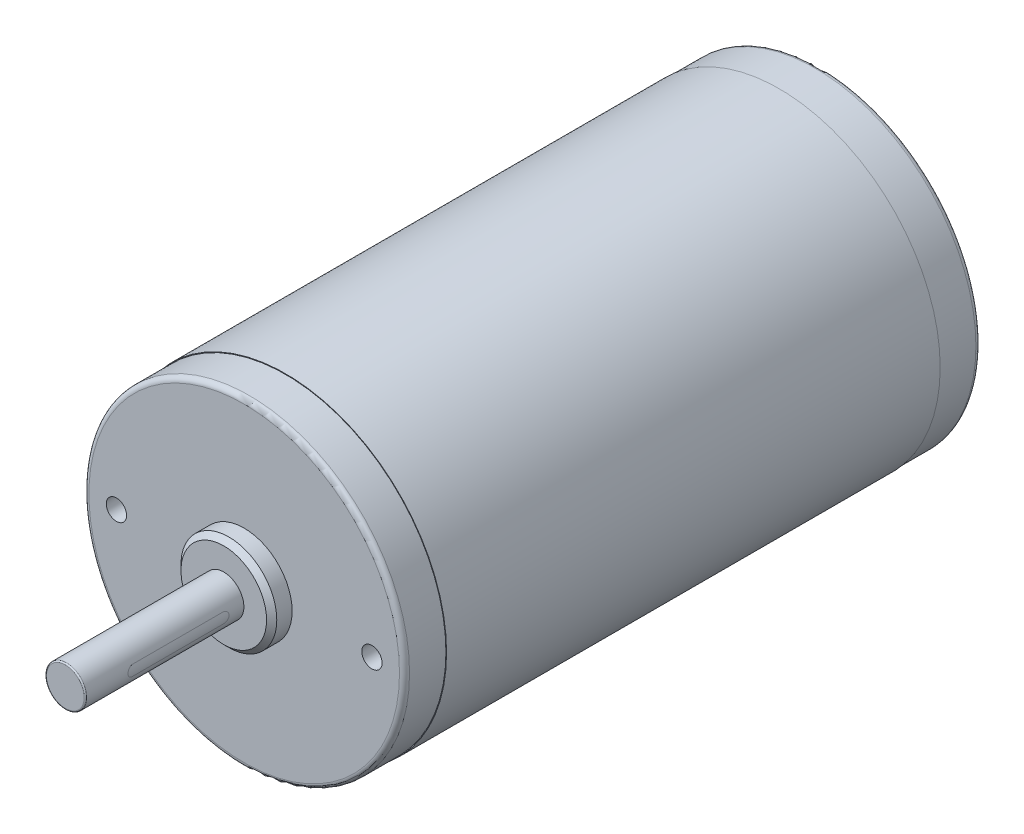
ISO-10303-21;
HEADER;
FILE_DESCRIPTION(('STEP AP214'),'2;1');
FILE_NAME('part.step','',(''),(''),'','','');
FILE_SCHEMA(('AUTOMOTIVE_DESIGN { 1 0 10303 214 1 1 1 1 }'));
ENDSEC;
DATA;
#1=APPLICATION_CONTEXT('core data for automotive mechanical design processes');
#2=APPLICATION_PROTOCOL_DEFINITION('international standard','automotive_design',2000,#1);
#3=PRODUCT_CONTEXT('',#1,'mechanical');
#4=PRODUCT('Part','Part','',(#3));
#5=PRODUCT_RELATED_PRODUCT_CATEGORY('part','',(#4));
#6=PRODUCT_DEFINITION_FORMATION('','',#4);
#7=PRODUCT_DEFINITION_CONTEXT('part definition',#1,'design');
#8=PRODUCT_DEFINITION('design','',#6,#7);
#9=PRODUCT_DEFINITION_SHAPE('','',#8);
#10=(LENGTH_UNIT() NAMED_UNIT(*) SI_UNIT(.MILLI.,.METRE.));
#11=(NAMED_UNIT(*) PLANE_ANGLE_UNIT() SI_UNIT($,.RADIAN.));
#12=(NAMED_UNIT(*) SI_UNIT($,.STERADIAN.) SOLID_ANGLE_UNIT());
#13=UNCERTAINTY_MEASURE_WITH_UNIT(LENGTH_MEASURE(1.E-05),#10,'distance_accuracy_value','');
#14=(GEOMETRIC_REPRESENTATION_CONTEXT(3) GLOBAL_UNCERTAINTY_ASSIGNED_CONTEXT((#13)) GLOBAL_UNIT_ASSIGNED_CONTEXT((#10,
#11,#12)) REPRESENTATION_CONTEXT('',''));
#15=CARTESIAN_POINT('',(0.,0.,0.));
#16=DIRECTION('',(0.,0.,1.));
#17=DIRECTION('',(1.,0.,0.));
#18=AXIS2_PLACEMENT_3D('',#15,#16,#17);
#19=CARTESIAN_POINT('',(35.56,109.2962,10.8204000000007));
#20=DIRECTION('',(0.,0.,-1.));
#21=DIRECTION('',(-1.,0.,0.));
#22=AXIS2_PLACEMENT_3D('',#19,#20,#21);
#23=CYLINDRICAL_SURFACE('',#22,32.0040000000005);
#24=CARTESIAN_POINT('',(35.56,109.2962,10.8204000000007));
#25=DIRECTION('',(0.,0.,-1.));
#26=DIRECTION('',(-1.,0.,0.));
#27=AXIS2_PLACEMENT_3D('',#24,#25,#26);
#28=CIRCLE('',#27,32.0040000000005);
#29=CARTESIAN_POINT('',(3.5559999999995,109.2962,10.8204000000007));
#30=VERTEX_POINT('',#29);
#31=EDGE_CURVE('P0_E181',#30,#30,#28,.T.);
#32=ORIENTED_EDGE('',*,*,#31,.T.);
#33=EDGE_LOOP('',(#32));
#34=FACE_BOUND('',#33,.T.);
#35=CARTESIAN_POINT('',(35.56,109.2962,-87.325199999998));
#36=DIRECTION('',(0.,0.,-1.));
#37=DIRECTION('',(-1.,0.,0.));
#38=AXIS2_PLACEMENT_3D('',#35,#36,#37);
#39=CIRCLE('',#38,32.0040000000005);
#40=CARTESIAN_POINT('',(3.5559999999995,109.2962,-87.325199999998));
#41=VERTEX_POINT('',#40);
#42=EDGE_CURVE('P0_E178',#41,#41,#39,.T.);
#43=ORIENTED_EDGE('',*,*,#42,.F.);
#44=EDGE_LOOP('',(#43));
#45=FACE_BOUND('',#44,.T.);
#46=ADVANCED_FACE('P0_F39',(#34,#45),#23,.T.);
#47=CARTESIAN_POINT('',(67.5640000000005,109.2962,10.8204000000007));
#48=DIRECTION('',(0.,0.,1.));
#49=DIRECTION('',(1.,0.,0.));
#50=AXIS2_PLACEMENT_3D('',#47,#48,#49);
#51=PLANE('',#50);
#52=CARTESIAN_POINT('',(35.56,109.2962,10.8204000000007));
#53=DIRECTION('',(0.,0.,1.));
#54=DIRECTION('',(1.,0.,0.));
#55=AXIS2_PLACEMENT_3D('',#52,#53,#54);
#56=CIRCLE('',#55,31.8770000000005);
#57=CARTESIAN_POINT('',(67.4370000000005,109.2962,10.8204000000007));
#58=VERTEX_POINT('',#57);
#59=EDGE_CURVE('P0_E169',#58,#58,#56,.T.);
#60=ORIENTED_EDGE('',*,*,#59,.F.);
#61=EDGE_LOOP('',(#60));
#62=FACE_BOUND('',#61,.T.);
#63=ORIENTED_EDGE('',*,*,#31,.F.);
#64=EDGE_LOOP('',(#63));
#65=FACE_BOUND('',#64,.T.);
#66=ADVANCED_FACE('P0_F228',(#62,#65),#51,.T.);
#67=CARTESIAN_POINT('',(35.56,109.2962,-87.325199999998));
#68=DIRECTION('',(0.,0.,-1.));
#69=DIRECTION('',(-1.,0.,0.));
#70=AXIS2_PLACEMENT_3D('',#67,#68,#69);
#71=PLANE('',#70);
#72=CARTESIAN_POINT('',(35.56,109.2962,-87.325199999998));
#73=DIRECTION('',(0.,0.,-1.));
#74=DIRECTION('',(-1.,0.,0.));
#75=AXIS2_PLACEMENT_3D('',#72,#73,#74);
#76=CIRCLE('',#75,31.8770000000005);
#77=CARTESIAN_POINT('',(3.68299999999951,109.2962,-87.325199999998));
#78=VERTEX_POINT('',#77);
#79=EDGE_CURVE('P0_E175',#78,#78,#76,.T.);
#80=ORIENTED_EDGE('',*,*,#79,.F.);
#81=EDGE_LOOP('',(#80));
#82=FACE_BOUND('',#81,.T.);
#83=ORIENTED_EDGE('',*,*,#42,.T.);
#84=EDGE_LOOP('',(#83));
#85=FACE_BOUND('',#84,.T.);
#86=ADVANCED_FACE('P0_F234',(#82,#85),#71,.T.);
#87=CARTESIAN_POINT('',(35.56,109.2962,-95.554799999998));
#88=DIRECTION('',(0.,0.,1.));
#89=DIRECTION('',(1.,0.,0.));
#90=AXIS2_PLACEMENT_3D('',#87,#88,#89);
#91=CYLINDRICAL_SURFACE('',#90,31.8770000000005);
#92=CARTESIAN_POINT('',(35.56,109.2962,-94.554799999998));
#93=DIRECTION('',(0.,0.,-1.));
#94=DIRECTION('',(-1.,0.,0.));
#95=AXIS2_PLACEMENT_3D('',#92,#93,#94);
#96=CIRCLE('',#95,31.8770000000005);
#97=CARTESIAN_POINT('',(3.68299999999951,109.2962,-94.554799999998));
#98=VERTEX_POINT('',#97);
#99=EDGE_CURVE('P0_E211',#98,#98,#96,.F.);
#100=ORIENTED_EDGE('',*,*,#99,.T.);
#101=EDGE_LOOP('',(#100));
#102=FACE_BOUND('',#101,.T.);
#103=ORIENTED_EDGE('',*,*,#79,.T.);
#104=EDGE_LOOP('',(#103));
#105=FACE_BOUND('',#104,.T.);
#106=ADVANCED_FACE('P0_F292',(#102,#105),#91,.T.);
#107=CARTESIAN_POINT('',(35.56,109.2962,-95.554799999998));
#108=DIRECTION('',(0.,0.,-1.));
#109=DIRECTION('',(-1.,0.,0.));
#110=AXIS2_PLACEMENT_3D('',#107,#108,#109);
#111=PLANE('',#110);
#112=CARTESIAN_POINT('',(35.56,109.2962,-95.554799999998));
#113=DIRECTION('',(0.,0.,-1.));
#114=DIRECTION('',(-1.,0.,0.));
#115=AXIS2_PLACEMENT_3D('',#112,#113,#114);
#116=CIRCLE('',#115,30.8770000000005);
#117=CARTESIAN_POINT('',(4.6829999999995,109.2962,-95.554799999998));
#118=VERTEX_POINT('',#117);
#119=EDGE_CURVE('P0_E208',#118,#118,#116,.T.);
#120=ORIENTED_EDGE('',*,*,#119,.T.);
#121=EDGE_LOOP('',(#120));
#122=FACE_BOUND('',#121,.T.);
#123=CARTESIAN_POINT('',(46.76735963712,127.903290682857,-95.554799999998));
#124=DIRECTION('',(0.,0.,-1.));
#125=DIRECTION('',(-1.,0.,0.));
#126=AXIS2_PLACEMENT_3D('',#123,#124,#125);
#127=CIRCLE('',#126,4.31800000197918);
#128=CARTESIAN_POINT('',(42.4493596351408,127.903290682857,-95.554799999998));
#129=VERTEX_POINT('',#128);
#130=EDGE_CURVE('P0_E187',#129,#129,#127,.T.);
#131=ORIENTED_EDGE('',*,*,#130,.F.);
#132=EDGE_LOOP('',(#131));
#133=FACE_BOUND('',#132,.T.);
#134=CARTESIAN_POINT('',(54.1670906808811,120.503559639095,-95.554799999998));
#135=DIRECTION('',(0.,0.,-1.));
#136=DIRECTION('',(-1.,0.,0.));
#137=AXIS2_PLACEMENT_3D('',#134,#135,#136);
#138=CIRCLE('',#137,4.3180000019652);
#139=CARTESIAN_POINT('',(49.8490906789159,120.503559639095,-95.554799999998));
#140=VERTEX_POINT('',#139);
#141=EDGE_CURVE('P0_E184',#140,#140,#138,.T.);
#142=ORIENTED_EDGE('',*,*,#141,.F.);
#143=EDGE_LOOP('',(#142));
#144=FACE_BOUND('',#143,.T.);
#145=CARTESIAN_POINT('',(35.56,109.2962,-95.554799999998));
#146=DIRECTION('',(0.,0.,-1.));
#147=DIRECTION('',(-1.,0.,0.));
#148=AXIS2_PLACEMENT_3D('',#145,#146,#147);
#149=CIRCLE('',#148,15.0368000000003);
#150=CARTESIAN_POINT('',(20.5231999999997,109.2962,-95.554799999998));
#151=VERTEX_POINT('',#150);
#152=EDGE_CURVE('P0_E172',#151,#151,#149,.T.);
#153=ORIENTED_EDGE('',*,*,#152,.F.);
#154=EDGE_LOOP('',(#153));
#155=FACE_BOUND('',#154,.T.);
#156=ADVANCED_FACE('P0_F288',(#122,#133,#144,#155),#111,.T.);
#157=CARTESIAN_POINT('',(35.56,109.2962,-100.317299999998));
#158=DIRECTION('',(0.,0.,1.));
#159=DIRECTION('',(1.,0.,0.));
#160=AXIS2_PLACEMENT_3D('',#157,#158,#159);
#161=CYLINDRICAL_SURFACE('',#160,15.0368000000003);
#162=CARTESIAN_POINT('',(35.56,109.2962,-99.317299999998));
#163=DIRECTION('',(0.,0.,-1.));
#164=DIRECTION('',(-1.,0.,0.));
#165=AXIS2_PLACEMENT_3D('',#162,#163,#164);
#166=CIRCLE('',#165,15.0368000000003);
#167=CARTESIAN_POINT('',(20.5231999999997,109.2962,-99.317299999998));
#168=VERTEX_POINT('',#167);
#169=EDGE_CURVE('P0_E11',#168,#168,#166,.F.);
#170=ORIENTED_EDGE('',*,*,#169,.T.);
#171=EDGE_LOOP('',(#170));
#172=FACE_BOUND('',#171,.T.);
#173=ORIENTED_EDGE('',*,*,#152,.T.);
#174=EDGE_LOOP('',(#173));
#175=FACE_BOUND('',#174,.T.);
#176=ADVANCED_FACE('P0_F285',(#172,#175),#161,.T.);
#177=CARTESIAN_POINT('',(35.56,109.2962,-100.317299999998));
#178=DIRECTION('',(0.,0.,-1.));
#179=DIRECTION('',(-1.,0.,0.));
#180=AXIS2_PLACEMENT_3D('',#177,#178,#179);
#181=PLANE('',#180);
#182=CARTESIAN_POINT('',(35.56,109.2962,-100.317299999998));
#183=DIRECTION('',(0.,0.,-1.));
#184=DIRECTION('',(-1.,0.,0.));
#185=AXIS2_PLACEMENT_3D('',#182,#183,#184);
#186=CIRCLE('',#185,14.0368000000003);
#187=CARTESIAN_POINT('',(21.5231999999997,109.2962,-100.317299999998));
#188=VERTEX_POINT('',#187);
#189=EDGE_CURVE('P0_E47',#188,#188,#186,.T.);
#190=ORIENTED_EDGE('',*,*,#189,.T.);
#191=EDGE_LOOP('',(#190));
#192=FACE_BOUND('',#191,.T.);
#193=ADVANCED_FACE('P0_F216',(#192),#181,.T.);
#194=CARTESIAN_POINT('',(35.56,109.2962,19.05));
#195=DIRECTION('',(0.,0.,-1.));
#196=DIRECTION('',(-1.,0.,0.));
#197=AXIS2_PLACEMENT_3D('',#194,#195,#196);
#198=CYLINDRICAL_SURFACE('',#197,31.8770000000005);
#199=CARTESIAN_POINT('',(35.56,109.2962,18.05));
#200=DIRECTION('',(0.,0.,1.));
#201=DIRECTION('',(1.,0.,0.));
#202=AXIS2_PLACEMENT_3D('',#199,#200,#201);
#203=CIRCLE('',#202,31.8770000000005);
#204=CARTESIAN_POINT('',(67.4370000000005,109.2962,18.05));
#205=VERTEX_POINT('',#204);
#206=EDGE_CURVE('P0_E205',#205,#205,#203,.F.);
#207=ORIENTED_EDGE('',*,*,#206,.T.);
#208=EDGE_LOOP('',(#207));
#209=FACE_BOUND('',#208,.T.);
#210=ORIENTED_EDGE('',*,*,#59,.T.);
#211=EDGE_LOOP('',(#210));
#212=FACE_BOUND('',#211,.T.);
#213=ADVANCED_FACE('P0_F260',(#209,#212),#198,.T.);
#214=CARTESIAN_POINT('',(35.56,109.2962,19.05));
#215=DIRECTION('',(0.,0.,1.));
#216=DIRECTION('',(1.,0.,0.));
#217=AXIS2_PLACEMENT_3D('',#214,#215,#216);
#218=PLANE('',#217);
#219=CARTESIAN_POINT('',(35.56,109.2962,19.05));
#220=DIRECTION('',(0.,0.,1.));
#221=DIRECTION('',(1.,0.,0.));
#222=AXIS2_PLACEMENT_3D('',#219,#220,#221);
#223=CIRCLE('',#222,30.8770000000005);
#224=CARTESIAN_POINT('',(66.4370000000005,109.2962,19.05));
#225=VERTEX_POINT('',#224);
#226=EDGE_CURVE('P0_E202',#225,#225,#223,.T.);
#227=ORIENTED_EDGE('',*,*,#226,.T.);
#228=EDGE_LOOP('',(#227));
#229=FACE_BOUND('',#228,.T.);
#230=CARTESIAN_POINT('',(10.1599999999994,109.2962,19.05));
#231=DIRECTION('',(0.,0.,1.));
#232=DIRECTION('',(1.,0.,0.));
#233=AXIS2_PLACEMENT_3D('',#230,#231,#232);
#234=CIRCLE('',#233,2.01930000000002);
#235=CARTESIAN_POINT('',(12.1792999999994,109.2962,19.05));
#236=VERTEX_POINT('',#235);
#237=EDGE_CURVE('P0_E96',#236,#236,#234,.T.);
#238=ORIENTED_EDGE('',*,*,#237,.F.);
#239=EDGE_LOOP('',(#238));
#240=FACE_BOUND('',#239,.T.);
#241=CARTESIAN_POINT('',(60.96,109.2962,19.05));
#242=DIRECTION('',(0.,0.,1.));
#243=DIRECTION('',(1.,0.,0.));
#244=AXIS2_PLACEMENT_3D('',#241,#242,#243);
#245=CIRCLE('',#244,2.01930000000002);
#246=CARTESIAN_POINT('',(62.9793,109.2962,19.05));
#247=VERTEX_POINT('',#246);
#248=EDGE_CURVE('P0_E95',#247,#247,#245,.T.);
#249=ORIENTED_EDGE('',*,*,#248,.F.);
#250=EDGE_LOOP('',(#249));
#251=FACE_BOUND('',#250,.T.);
#252=CARTESIAN_POINT('',(35.56,109.2962,19.05));
#253=DIRECTION('',(0.,0.,1.));
#254=DIRECTION('',(1.,0.,0.));
#255=AXIS2_PLACEMENT_3D('',#252,#253,#254);
#256=CIRCLE('',#255,9.52500000000019);
#257=CARTESIAN_POINT('',(45.0850000000002,109.2962,19.05));
#258=VERTEX_POINT('',#257);
#259=EDGE_CURVE('P0_E166',#258,#258,#256,.T.);
#260=ORIENTED_EDGE('',*,*,#259,.F.);
#261=EDGE_LOOP('',(#260));
#262=FACE_BOUND('',#261,.T.);
#263=ADVANCED_FACE('P0_F256',(#229,#240,#251,#262),#218,.T.);
#264=CARTESIAN_POINT('',(35.56,109.2962,23.114));
#265=DIRECTION('',(0.,0.,-1.));
#266=DIRECTION('',(-1.,0.,0.));
#267=AXIS2_PLACEMENT_3D('',#264,#265,#266);
#268=CYLINDRICAL_SURFACE('',#267,9.52500000000019);
#269=CARTESIAN_POINT('',(35.56,109.2962,22.0980000018232));
#270=DIRECTION('',(0.,0.,1.));
#271=DIRECTION('',(1.,0.,0.));
#272=AXIS2_PLACEMENT_3D('',#269,#270,#271);
#273=CIRCLE('',#272,9.52500000000019);
#274=CARTESIAN_POINT('',(45.0850000000002,109.2962,22.0980000018232));
#275=VERTEX_POINT('',#274);
#276=EDGE_CURVE('P0_E193',#275,#275,#273,.F.);
#277=ORIENTED_EDGE('',*,*,#276,.T.);
#278=EDGE_LOOP('',(#277));
#279=FACE_BOUND('',#278,.T.);
#280=ORIENTED_EDGE('',*,*,#259,.T.);
#281=EDGE_LOOP('',(#280));
#282=FACE_BOUND('',#281,.T.);
#283=ADVANCED_FACE('P0_F259',(#279,#282),#268,.T.);
#284=CARTESIAN_POINT('',(35.56,109.2962,23.114));
#285=DIRECTION('',(0.,0.,1.));
#286=DIRECTION('',(1.,0.,0.));
#287=AXIS2_PLACEMENT_3D('',#284,#285,#286);
#288=PLANE('',#287);
#289=CARTESIAN_POINT('',(35.56,109.2962,23.114));
#290=DIRECTION('',(0.,0.,1.));
#291=DIRECTION('',(1.,0.,0.));
#292=AXIS2_PLACEMENT_3D('',#289,#290,#291);
#293=CIRCLE('',#292,8.50899999999979);
#294=CARTESIAN_POINT('',(44.0689999999998,109.2962,23.114));
#295=VERTEX_POINT('',#294);
#296=EDGE_CURVE('P0_E190',#295,#295,#293,.T.);
#297=ORIENTED_EDGE('',*,*,#296,.T.);
#298=EDGE_LOOP('',(#297));
#299=FACE_BOUND('',#298,.T.);
#300=CARTESIAN_POINT('',(35.56,109.2962,23.114));
#301=DIRECTION('',(0.,0.,1.));
#302=DIRECTION('',(1.,0.,0.));
#303=AXIS2_PLACEMENT_3D('',#300,#301,#302);
#304=CIRCLE('',#303,4.00000000000007);
#305=CARTESIAN_POINT('',(39.5600000000001,109.2962,23.114));
#306=VERTEX_POINT('',#305);
#307=EDGE_CURVE('P0_E122',#306,#306,#304,.T.);
#308=ORIENTED_EDGE('',*,*,#307,.F.);
#309=EDGE_LOOP('',(#308));
#310=FACE_BOUND('',#309,.T.);
#311=ADVANCED_FACE('P0_F269',(#299,#310),#288,.T.);
#312=CARTESIAN_POINT('',(35.56,109.2962,54.614));
#313=DIRECTION('',(0.,0.,-1.));
#314=DIRECTION('',(-1.,0.,0.));
#315=AXIS2_PLACEMENT_3D('',#312,#313,#314);
#316=CYLINDRICAL_SURFACE('',#315,4.00000000000007);
#317=CARTESIAN_POINT('',(35.56,109.2962,54.36));
#318=DIRECTION('',(0.,0.,1.));
#319=DIRECTION('',(1.,0.,0.));
#320=AXIS2_PLACEMENT_3D('',#317,#318,#319);
#321=CIRCLE('',#320,4.00000000000007);
#322=CARTESIAN_POINT('',(39.5600000000001,109.2962,54.36));
#323=VERTEX_POINT('',#322);
#324=EDGE_CURVE('P0_E199',#323,#323,#321,.F.);
#325=ORIENTED_EDGE('',*,*,#324,.T.);
#326=EDGE_LOOP('',(#325));
#327=FACE_BOUND('',#326,.T.);
#328=DIRECTION('',(0.,0.,-1.));
#329=VECTOR('',#328,1.);
#330=CARTESIAN_POINT('',(39.4197279696891,110.3462,54.614));
#331=LINE('',#330,#329);
#332=CARTESIAN_POINT('',(39.4197279696891,110.3462,45.1));
#333=VERTEX_POINT('',#332);
#334=CARTESIAN_POINT('',(39.4197279696891,110.3462,27.1));
#335=VERTEX_POINT('',#334);
#336=EDGE_CURVE('P0_E132',#333,#335,#331,.T.);
#337=ORIENTED_EDGE('',*,*,#336,.T.);
#338=CARTESIAN_POINT('',(39.4197279696891,110.3462,27.1));
#339=CARTESIAN_POINT('',(39.4197258950768,110.34620041025,27.0710051009623));
#340=CARTESIAN_POINT('',(39.4200551064329,110.344998227256,27.0420246228058));
#341=CARTESIAN_POINT('',(39.4213547123988,110.340206209835,26.9842814282389));
#342=CARTESIAN_POINT('',(39.4223249908093,110.336616808112,26.9555186733196));
#343=CARTESIAN_POINT('',(39.4261578920524,110.322321932764,26.8699951160553));
#344=CARTESIAN_POINT('',(39.4299428342912,110.308089542303,26.8138236492985));
#345=CARTESIAN_POINT('',(39.4395286889104,110.270686835054,26.7047742036821));
#346=CARTESIAN_POINT('',(39.445329326456,110.247517736714,26.6518957769836));
#347=CARTESIAN_POINT('',(39.4582892232805,110.192930496084,26.5507488556207));
#348=CARTESIAN_POINT('',(39.4654488628844,110.161510043656,26.5024816571346));
#349=CARTESIAN_POINT('',(39.4805119710478,110.090509636998,26.4107922298844));
#350=CARTESIAN_POINT('',(39.4884281885094,110.050767743087,26.3674975328551));
#351=CARTESIAN_POINT('',(39.5040047400555,109.964586854037,26.2880931254825));
#352=CARTESIAN_POINT('',(39.5116649818293,109.91814547434,26.2519859843525));
#353=CARTESIAN_POINT('',(39.526010604883,109.818987620195,26.1874496103786));
#354=CARTESIAN_POINT('',(39.5326785635433,109.766183168704,26.159151481312));
#355=CARTESIAN_POINT('',(39.5441298010583,109.656397945762,26.1119111599868));
#356=CARTESIAN_POINT('',(39.5489153447307,109.599422291421,26.0929577177131));
#357=CARTESIAN_POINT('',(39.5549473168842,109.501171577289,26.0693758272655));
#358=CARTESIAN_POINT('',(39.5568321627736,109.46054623456,26.0621227253234));
#359=CARTESIAN_POINT('',(39.5593590428507,109.378686103609,26.052433965248));
#360=CARTESIAN_POINT('',(39.560001100914,109.337451327111,26.0499982145665));
#361=CARTESIAN_POINT('',(39.5599984549201,109.238305738357,26.0500025057704));
#362=CARTESIAN_POINT('',(39.5587300938834,109.18037887734,26.0548061723029));
#363=CARTESIAN_POINT('',(39.5537908073877,109.066174828257,26.0738680806171));
#364=CARTESIAN_POINT('',(39.5501176251492,109.009899241695,26.0881352034471));
#365=CARTESIAN_POINT('',(39.5407752151886,108.900688958064,26.1256289904428));
#366=CARTESIAN_POINT('',(39.5351088856793,108.847749541003,26.148842650214));
#367=CARTESIAN_POINT('',(39.5223803452478,108.746519851806,26.2035277086069));
#368=CARTESIAN_POINT('',(39.5153181479083,108.698229534436,26.2349990268771));
#369=CARTESIAN_POINT('',(39.5003832391547,108.606575585264,26.3060552920619));
#370=CARTESIAN_POINT('',(39.4924970081334,108.563331555532,26.3457916691671));
#371=CARTESIAN_POINT('',(39.4768899553604,108.484036309153,26.431929982209));
#372=CARTESIAN_POINT('',(39.4691691622905,108.447986330864,26.4783330633665));
#373=CARTESIAN_POINT('',(39.4546281048764,108.383519395399,26.5774412854526));
#374=CARTESIAN_POINT('',(39.447825217303,108.355241372008,26.6302394851058));
#375=CARTESIAN_POINT('',(39.4360941322255,108.308025058775,26.7400354515098));
#376=CARTESIAN_POINT('',(39.4311644713835,108.289079475123,26.7970298984879));
#377=CARTESIAN_POINT('',(39.424947536189,108.265530062073,26.8952701656664));
#378=CARTESIAN_POINT('',(39.4230031721686,108.258293447667,26.9358624533813));
#379=CARTESIAN_POINT('',(39.4203876966156,108.248624950633,27.0176289590907));
#380=CARTESIAN_POINT('',(39.419715789786,108.246190066839,27.058802797386));
#381=CARTESIAN_POINT('',(39.4197279696891,108.2462,27.1));
#382=B_SPLINE_CURVE_WITH_KNOTS('',3,(#338,#339,#340,#341,#342,#343,#344,#345,#346,#347,#348,
#349,#350,#351,#352,#353,#354,#355,#356,#357,#358,#359,#360,#361,#362,#363,#364,#365,#366,#367,
#368,#369,#370,#371,#372,#373,#374,#375,#376,#377,#378,#379,#380,#381),.UNSPECIFIED.,.F.,.F.,(4,
2,2,2,2,2,2,2,2,2,2,2,2,2,2,2,2,2,2,2,2,4),(0.,0.0869295778834455,0.173843403286115,
0.347151826879623,0.520436629596136,0.693769998810197,0.870856390838592,1.0480059697082,
1.22797015523124,1.40771715061754,1.53136439682191,1.65500926755904,1.82853892099358,
2.00223165541559,2.17567286221396,2.34911238140168,2.52606492372391,2.7030478997598,
2.88301467869372,3.06284057971519,3.18638852057381,3.30985921734618),.UNSPECIFIED.);
#383=CARTESIAN_POINT('',(39.4197279696891,108.2462,27.1));
#384=VERTEX_POINT('',#383);
#385=EDGE_CURVE('P0_E118',#335,#384,#382,.T.);
#386=ORIENTED_EDGE('',*,*,#385,.T.);
#387=DIRECTION('',(0.,0.,-1.));
#388=VECTOR('',#387,1.);
#389=CARTESIAN_POINT('',(39.4197279696891,108.2462,54.614));
#390=LINE('',#389,#388);
#391=CARTESIAN_POINT('',(39.4197279696891,108.2462,45.1));
#392=VERTEX_POINT('',#391);
#393=EDGE_CURVE('P0_E145',#384,#392,#390,.F.);
#394=ORIENTED_EDGE('',*,*,#393,.T.);
#395=CARTESIAN_POINT('',(39.4197279696891,108.2462,45.1));
#396=CARTESIAN_POINT('',(39.4197258950768,108.24619958975,45.1289948990377));
#397=CARTESIAN_POINT('',(39.4200551064328,108.247401772744,45.1579753771942));
#398=CARTESIAN_POINT('',(39.4213547123988,108.252193790165,45.2157185717611));
#399=CARTESIAN_POINT('',(39.4223249908093,108.255783191888,45.2444813266804));
#400=CARTESIAN_POINT('',(39.4261578920524,108.270078067236,45.3300048839447));
#401=CARTESIAN_POINT('',(39.4299428342912,108.284310457697,45.3861763507014));
#402=CARTESIAN_POINT('',(39.4395286889104,108.321713164946,45.4952257963179));
#403=CARTESIAN_POINT('',(39.445329326456,108.344882263286,45.5481042230163));
#404=CARTESIAN_POINT('',(39.4582892232805,108.399469503916,45.6492511443793));
#405=CARTESIAN_POINT('',(39.4654488628844,108.430889956344,45.6975183428654));
#406=CARTESIAN_POINT('',(39.4805119710478,108.501890363002,45.7892077701155));
#407=CARTESIAN_POINT('',(39.4884281885094,108.541632256913,45.8325024671448));
#408=CARTESIAN_POINT('',(39.5040047400555,108.627813145963,45.9119068745175));
#409=CARTESIAN_POINT('',(39.5116649818293,108.67425452566,45.9480140156475));
#410=CARTESIAN_POINT('',(39.526010604883,108.773412379805,46.0125503896214));
#411=CARTESIAN_POINT('',(39.5326785635433,108.826216831296,46.040848518688));
#412=CARTESIAN_POINT('',(39.5441298010583,108.936002054238,46.0880888400132));
#413=CARTESIAN_POINT('',(39.5489153447307,108.992977708579,46.1070422822868));
#414=CARTESIAN_POINT('',(39.5549473168842,109.091228422711,46.1306241727345));
#415=CARTESIAN_POINT('',(39.5568321627736,109.13185376544,46.1378772746766));
#416=CARTESIAN_POINT('',(39.5593590428507,109.213713896391,46.147566034752));
#417=CARTESIAN_POINT('',(39.560001100914,109.254948672889,46.1500017854335));
#418=CARTESIAN_POINT('',(39.5599984549201,109.354094261643,46.1499974942296));
#419=CARTESIAN_POINT('',(39.5587300938834,109.412021122661,46.1451938276971));
#420=CARTESIAN_POINT('',(39.5537908073877,109.526225171743,46.1261319193829));
#421=CARTESIAN_POINT('',(39.5501176251492,109.582500758305,46.1118647965529));
#422=CARTESIAN_POINT('',(39.5407752151886,109.691711041936,46.0743710095572));
#423=CARTESIAN_POINT('',(39.5351088856793,109.744650458997,46.051157349786));
#424=CARTESIAN_POINT('',(39.5223803452478,109.845880148194,45.9964722913931));
#425=CARTESIAN_POINT('',(39.5153181479083,109.894170465564,45.9650009731229));
#426=CARTESIAN_POINT('',(39.5003832391547,109.985824414736,45.8939447079381));
#427=CARTESIAN_POINT('',(39.4924970081334,110.029068444468,45.8542083308329));
#428=CARTESIAN_POINT('',(39.4768899553604,110.108363690847,45.768070017791));
#429=CARTESIAN_POINT('',(39.4691691622905,110.144413669136,45.7216669366335));
#430=CARTESIAN_POINT('',(39.4546281048764,110.208880604601,45.6225587145474));
#431=CARTESIAN_POINT('',(39.447825217303,110.237158627992,45.5697605148942));
#432=CARTESIAN_POINT('',(39.4360941322255,110.284374941225,45.4599645484902));
#433=CARTESIAN_POINT('',(39.4311644713835,110.303320524877,45.4029701015121));
#434=CARTESIAN_POINT('',(39.424947536189,110.326869937927,45.3047298343336));
#435=CARTESIAN_POINT('',(39.4230031721686,110.334106552333,45.2641375466187));
#436=CARTESIAN_POINT('',(39.4203876966156,110.343775049367,45.1823710409093));
#437=CARTESIAN_POINT('',(39.419715789786,110.346209933161,45.141197202614));
#438=CARTESIAN_POINT('',(39.4197279696891,110.3462,45.1));
#439=B_SPLINE_CURVE_WITH_KNOTS('',3,(#395,#396,#397,#398,#399,#400,#401,#402,#403,#404,#405,
#406,#407,#408,#409,#410,#411,#412,#413,#414,#415,#416,#417,#418,#419,#420,#421,#422,#423,#424,
#425,#426,#427,#428,#429,#430,#431,#432,#433,#434,#435,#436,#437,#438),.UNSPECIFIED.,.F.,.F.,(4,
2,2,2,2,2,2,2,2,2,2,2,2,2,2,2,2,2,2,2,2,4),(0.,0.0869295778834422,0.17384340328612,
0.347151826879625,0.520436629596116,0.69376999881019,0.870856390838584,1.04800596970821,
1.22797015523126,1.40771715061754,1.53136439682193,1.65500926755904,1.82853892099362,
2.0022316554156,2.17567286221397,2.34911238140169,2.52606492372393,2.70304789975981,
2.88301467869373,3.0628405797152,3.18638852057382,3.3098592173462),.UNSPECIFIED.);
#440=EDGE_CURVE('P0_E54',#392,#333,#439,.T.);
#441=ORIENTED_EDGE('',*,*,#440,.T.);
#442=EDGE_LOOP('',(#337,#386,#394,#441));
#443=FACE_BOUND('',#442,.T.);
#444=ORIENTED_EDGE('',*,*,#307,.T.);
#445=EDGE_LOOP('',(#444));
#446=FACE_BOUND('',#445,.T.);
#447=ADVANCED_FACE('P0_F275',(#327,#443,#446),#316,.T.);
#448=CARTESIAN_POINT('',(35.56,109.2962,54.614));
#449=DIRECTION('',(0.,0.,1.));
#450=DIRECTION('',(1.,0.,0.));
#451=AXIS2_PLACEMENT_3D('',#448,#449,#450);
#452=PLANE('',#451);
#453=CARTESIAN_POINT('',(35.56,109.2962,54.614));
#454=DIRECTION('',(0.,0.,1.));
#455=DIRECTION('',(1.,0.,0.));
#456=AXIS2_PLACEMENT_3D('',#453,#454,#455);
#457=CIRCLE('',#456,3.74600000000007);
#458=CARTESIAN_POINT('',(39.3060000000001,109.2962,54.614));
#459=VERTEX_POINT('',#458);
#460=EDGE_CURVE('P0_E196',#459,#459,#457,.T.);
#461=ORIENTED_EDGE('',*,*,#460,.T.);
#462=EDGE_LOOP('',(#461));
#463=FACE_BOUND('',#462,.T.);
#464=ADVANCED_FACE('P0_F338',(#463),#452,.T.);
#465=CARTESIAN_POINT('',(67.5650000000005,109.2962,27.1));
#466=DIRECTION('',(-1.,0.,0.));
#467=DIRECTION('',(0.,0.,1.));
#468=AXIS2_PLACEMENT_3D('',#465,#466,#467);
#469=CYLINDRICAL_SURFACE('',#468,1.05);
#470=ORIENTED_EDGE('',*,*,#385,.F.);
#471=DIRECTION('',(-1.,0.,0.));
#472=VECTOR('',#471,1.);
#473=CARTESIAN_POINT('',(67.5650000000005,110.3462,27.1));
#474=LINE('',#473,#472);
#475=CARTESIAN_POINT('',(38.3600000000001,110.3462,27.1));
#476=VERTEX_POINT('',#475);
#477=EDGE_CURVE('P0_E136',#335,#476,#474,.T.);
#478=ORIENTED_EDGE('',*,*,#477,.T.);
#479=CARTESIAN_POINT('',(38.3600000000001,109.2962,27.1));
#480=DIRECTION('',(-1.,0.,0.));
#481=DIRECTION('',(0.,0.,1.));
#482=AXIS2_PLACEMENT_3D('',#479,#480,#481);
#483=CIRCLE('',#482,1.05);
#484=CARTESIAN_POINT('',(38.3600000000001,108.2462,27.1));
#485=VERTEX_POINT('',#484);
#486=EDGE_CURVE('P0_E129',#476,#485,#483,.T.);
#487=ORIENTED_EDGE('',*,*,#486,.T.);
#488=DIRECTION('',(-1.,0.,0.));
#489=VECTOR('',#488,1.);
#490=CARTESIAN_POINT('',(67.5650000000005,108.2462,27.1));
#491=LINE('',#490,#489);
#492=EDGE_CURVE('P0_E62',#384,#485,#491,.T.);
#493=ORIENTED_EDGE('',*,*,#492,.F.);
#494=EDGE_LOOP('',(#470,#478,#487,#493));
#495=FACE_BOUND('',#494,.T.);
#496=ADVANCED_FACE('P0_F343',(#495),#469,.F.);
#497=CARTESIAN_POINT('',(67.5650000000005,110.3462,45.1));
#498=DIRECTION('',(0.,1.,0.));
#499=DIRECTION('',(0.,0.,1.));
#500=AXIS2_PLACEMENT_3D('',#497,#498,#499);
#501=PLANE('',#500);
#502=ORIENTED_EDGE('',*,*,#336,.F.);
#503=DIRECTION('',(-1.,0.,0.));
#504=VECTOR('',#503,1.);
#505=CARTESIAN_POINT('',(67.5650000000005,110.3462,45.1));
#506=LINE('',#505,#504);
#507=CARTESIAN_POINT('',(38.3600000000001,110.3462,45.1));
#508=VERTEX_POINT('',#507);
#509=EDGE_CURVE('P0_E159',#333,#508,#506,.T.);
#510=ORIENTED_EDGE('',*,*,#509,.T.);
#511=DIRECTION('',(0.,0.,-1.));
#512=VECTOR('',#511,1.);
#513=CARTESIAN_POINT('',(38.3600000000001,110.3462,45.1));
#514=LINE('',#513,#512);
#515=EDGE_CURVE('P0_E119',#508,#476,#514,.T.);
#516=ORIENTED_EDGE('',*,*,#515,.T.);
#517=ORIENTED_EDGE('',*,*,#477,.F.);
#518=EDGE_LOOP('',(#502,#510,#516,#517));
#519=FACE_BOUND('',#518,.T.);
#520=ADVANCED_FACE('P0_F413',(#519),#501,.F.);
#521=CARTESIAN_POINT('',(67.5650000000005,109.2962,45.1));
#522=DIRECTION('',(-1.,0.,0.));
#523=DIRECTION('',(0.,0.,1.));
#524=AXIS2_PLACEMENT_3D('',#521,#522,#523);
#525=CYLINDRICAL_SURFACE('',#524,1.05);
#526=ORIENTED_EDGE('',*,*,#440,.F.);
#527=DIRECTION('',(-1.,0.,0.));
#528=VECTOR('',#527,1.);
#529=CARTESIAN_POINT('',(67.5650000000005,108.2462,45.1));
#530=LINE('',#529,#528);
#531=CARTESIAN_POINT('',(38.3600000000001,108.2462,45.1));
#532=VERTEX_POINT('',#531);
#533=EDGE_CURVE('P0_E131',#392,#532,#530,.T.);
#534=ORIENTED_EDGE('',*,*,#533,.T.);
#535=CARTESIAN_POINT('',(38.3600000000001,109.2962,45.1));
#536=DIRECTION('',(-1.,0.,0.));
#537=DIRECTION('',(0.,0.,1.));
#538=AXIS2_PLACEMENT_3D('',#535,#536,#537);
#539=CIRCLE('',#538,1.05);
#540=EDGE_CURVE('P0_E123',#532,#508,#539,.T.);
#541=ORIENTED_EDGE('',*,*,#540,.T.);
#542=ORIENTED_EDGE('',*,*,#509,.F.);
#543=EDGE_LOOP('',(#526,#534,#541,#542));
#544=FACE_BOUND('',#543,.T.);
#545=ADVANCED_FACE('P0_F421',(#544),#525,.F.);
#546=CARTESIAN_POINT('',(67.5650000000005,108.2462,27.1));
#547=DIRECTION('',(0.,-1.,0.));
#548=DIRECTION('',(0.,0.,-1.));
#549=AXIS2_PLACEMENT_3D('',#546,#547,#548);
#550=PLANE('',#549);
#551=ORIENTED_EDGE('',*,*,#393,.F.);
#552=ORIENTED_EDGE('',*,*,#492,.T.);
#553=DIRECTION('',(0.,0.,1.));
#554=VECTOR('',#553,1.);
#555=CARTESIAN_POINT('',(38.3600000000001,108.2462,27.1));
#556=LINE('',#555,#554);
#557=EDGE_CURVE('P0_E126',#485,#532,#556,.T.);
#558=ORIENTED_EDGE('',*,*,#557,.T.);
#559=ORIENTED_EDGE('',*,*,#533,.F.);
#560=EDGE_LOOP('',(#551,#552,#558,#559));
#561=FACE_BOUND('',#560,.T.);
#562=ADVANCED_FACE('P0_F430',(#561),#550,.F.);
#563=CARTESIAN_POINT('',(38.3600000000001,109.2962,27.1));
#564=DIRECTION('',(-1.,0.,0.));
#565=DIRECTION('',(0.,0.,1.));
#566=AXIS2_PLACEMENT_3D('',#563,#564,#565);
#567=PLANE('',#566);
#568=ORIENTED_EDGE('',*,*,#486,.F.);
#569=ORIENTED_EDGE('',*,*,#515,.F.);
#570=ORIENTED_EDGE('',*,*,#540,.F.);
#571=ORIENTED_EDGE('',*,*,#557,.F.);
#572=EDGE_LOOP('',(#568,#569,#570,#571));
#573=FACE_BOUND('',#572,.T.);
#574=ADVANCED_FACE('P0_F438',(#573),#567,.F.);
#575=CARTESIAN_POINT('',(54.1670906808811,120.503559639095,-95.554799999998));
#576=DIRECTION('',(0.,0.,-1.));
#577=DIRECTION('',(-1.,0.,0.));
#578=AXIS2_PLACEMENT_3D('',#575,#576,#577);
#579=CYLINDRICAL_SURFACE('',#578,4.3180000019652);
#580=ORIENTED_EDGE('',*,*,#141,.T.);
#581=EDGE_LOOP('',(#580));
#582=FACE_BOUND('',#581,.T.);
#583=CARTESIAN_POINT('',(54.1670906808811,120.503559639095,-95.6026999960083));
#584=DIRECTION('',(0.,0.,-1.));
#585=DIRECTION('',(-1.,0.,0.));
#586=AXIS2_PLACEMENT_3D('',#583,#584,#585);
#587=CIRCLE('',#586,4.3180000019652);
#588=CARTESIAN_POINT('',(49.8490906789159,120.503559639095,-95.6026999960083));
#589=VERTEX_POINT('',#588);
#590=EDGE_CURVE('P0_E112',#589,#589,#587,.T.);
#591=ORIENTED_EDGE('',*,*,#590,.F.);
#592=EDGE_LOOP('',(#591));
#593=FACE_BOUND('',#592,.T.);
#594=ADVANCED_FACE('P0_F446',(#582,#593),#579,.T.);
#595=CARTESIAN_POINT('',(54.1670906808811,120.503559639095,-97.8026999980238));
#596=DIRECTION('',(0.,0.,-1.));
#597=DIRECTION('',(-1.,0.,0.));
#598=AXIS2_PLACEMENT_3D('',#595,#596,#597);
#599=PLANE('',#598);
#600=CARTESIAN_POINT('',(54.1670906808811,120.503559639095,-97.8026999980238));
#601=DIRECTION('',(0.,0.,-1.));
#602=DIRECTION('',(-1.,0.,0.));
#603=AXIS2_PLACEMENT_3D('',#600,#601,#602);
#604=CIRCLE('',#603,2.11799999994966);
#605=CARTESIAN_POINT('',(52.0490906809314,120.503559639095,-97.8026999980238));
#606=VERTEX_POINT('',#605);
#607=EDGE_CURVE('P0_E115',#606,#606,#604,.T.);
#608=ORIENTED_EDGE('',*,*,#607,.T.);
#609=EDGE_LOOP('',(#608));
#610=FACE_BOUND('',#609,.T.);
#611=ADVANCED_FACE('P0_F454',(#610),#599,.T.);
#612=CARTESIAN_POINT('',(54.1670906808811,120.503559639095,-97.8026999980238));
#613=DIRECTION('',(0.,0.,1.));
#614=DIRECTION('',(1.,0.,0.));
#615=AXIS2_PLACEMENT_3D('',#612,#613,#614);
#616=CONICAL_SURFACE('',#615,2.11799999994966,0.78539816339745);
#617=ORIENTED_EDGE('',*,*,#590,.T.);
#618=EDGE_LOOP('',(#617));
#619=FACE_BOUND('',#618,.T.);
#620=ORIENTED_EDGE('',*,*,#607,.F.);
#621=EDGE_LOOP('',(#620));
#622=FACE_BOUND('',#621,.T.);
#623=ADVANCED_FACE('P0_F463',(#619,#622),#616,.T.);
#624=CARTESIAN_POINT('',(46.76735963712,127.903290682857,-95.554799999998));
#625=DIRECTION('',(0.,0.,-1.));
#626=DIRECTION('',(-1.,0.,0.));
#627=AXIS2_PLACEMENT_3D('',#624,#625,#626);
#628=CYLINDRICAL_SURFACE('',#627,4.31800000197918);
#629=ORIENTED_EDGE('',*,*,#130,.T.);
#630=EDGE_LOOP('',(#629));
#631=FACE_BOUND('',#630,.T.);
#632=CARTESIAN_POINT('',(46.76735963712,127.903290682857,-95.6026999960785));
#633=DIRECTION('',(0.,0.,-1.));
#634=DIRECTION('',(-1.,0.,0.));
#635=AXIS2_PLACEMENT_3D('',#632,#633,#634);
#636=CIRCLE('',#635,4.31800000197918);
#637=CARTESIAN_POINT('',(42.4493596351408,127.903290682857,-95.6026999960785));
#638=VERTEX_POINT('',#637);
#639=EDGE_CURVE('P0_E106',#638,#638,#636,.T.);
#640=ORIENTED_EDGE('',*,*,#639,.F.);
#641=EDGE_LOOP('',(#640));
#642=FACE_BOUND('',#641,.T.);
#643=ADVANCED_FACE('P0_F473',(#631,#642),#628,.T.);
#644=CARTESIAN_POINT('',(46.76735963712,127.903290682857,-97.8026999980236));
#645=DIRECTION('',(0.,0.,-1.));
#646=DIRECTION('',(-1.,0.,0.));
#647=AXIS2_PLACEMENT_3D('',#644,#645,#646);
#648=PLANE('',#647);
#649=CARTESIAN_POINT('',(46.76735963712,127.903290682857,-97.8026999980236));
#650=DIRECTION('',(0.,0.,-1.));
#651=DIRECTION('',(-1.,0.,0.));
#652=AXIS2_PLACEMENT_3D('',#649,#650,#651);
#653=CIRCLE('',#652,2.11800000003411);
#654=CARTESIAN_POINT('',(44.6493596370859,127.903290682857,-97.8026999980236));
#655=VERTEX_POINT('',#654);
#656=EDGE_CURVE('P0_E109',#655,#655,#653,.T.);
#657=ORIENTED_EDGE('',*,*,#656,.T.);
#658=EDGE_LOOP('',(#657));
#659=FACE_BOUND('',#658,.T.);
#660=ADVANCED_FACE('P0_F483',(#659),#648,.T.);
#661=CARTESIAN_POINT('',(46.76735963712,127.903290682857,-97.8026999980236));
#662=DIRECTION('',(0.,0.,1.));
#663=DIRECTION('',(1.,0.,0.));
#664=AXIS2_PLACEMENT_3D('',#661,#662,#663);
#665=CONICAL_SURFACE('',#664,2.11800000003411,0.785398163397448);
#666=ORIENTED_EDGE('',*,*,#639,.T.);
#667=EDGE_LOOP('',(#666));
#668=FACE_BOUND('',#667,.T.);
#669=ORIENTED_EDGE('',*,*,#656,.F.);
#670=EDGE_LOOP('',(#669));
#671=FACE_BOUND('',#670,.T.);
#672=ADVANCED_FACE('P0_F492',(#668,#671),#665,.T.);
#673=CARTESIAN_POINT('',(60.96,109.2962,5.4356000000007));
#674=DIRECTION('',(0.,0.,1.));
#675=DIRECTION('',(1.,0.,0.));
#676=AXIS2_PLACEMENT_3D('',#673,#674,#675);
#677=CONICAL_SURFACE('',#676,2.01930000000002,1.02974425747654);
#678=CARTESIAN_POINT('',(60.96,109.2962,4.22228214870002));
#679=VERTEX_POINT('',#678);
#680=VERTEX_LOOP('',#679);
#681=FACE_BOUND('',#680,.T.);
#682=CARTESIAN_POINT('',(60.96,109.2962,5.4356000000007));
#683=DIRECTION('',(0.,0.,1.));
#684=DIRECTION('',(1.,0.,0.));
#685=AXIS2_PLACEMENT_3D('',#682,#683,#684);
#686=CIRCLE('',#685,2.01930000000002);
#687=CARTESIAN_POINT('',(62.9793,109.2962,5.4356000000007));
#688=VERTEX_POINT('',#687);
#689=EDGE_CURVE('P0_E99',#688,#688,#686,.T.);
#690=ORIENTED_EDGE('',*,*,#689,.T.);
#691=EDGE_LOOP('',(#690));
#692=FACE_BOUND('',#691,.T.);
#693=ADVANCED_FACE('P0_F502',(#681,#692),#677,.F.);
#694=CARTESIAN_POINT('',(60.96,109.2962,19.05));
#695=DIRECTION('',(0.,0.,1.));
#696=DIRECTION('',(1.,0.,0.));
#697=AXIS2_PLACEMENT_3D('',#694,#695,#696);
#698=CYLINDRICAL_SURFACE('',#697,2.01930000000002);
#699=ORIENTED_EDGE('',*,*,#689,.F.);
#700=EDGE_LOOP('',(#699));
#701=FACE_BOUND('',#700,.T.);
#702=ORIENTED_EDGE('',*,*,#248,.T.);
#703=EDGE_LOOP('',(#702));
#704=FACE_BOUND('',#703,.T.);
#705=ADVANCED_FACE('P0_F89',(#701,#704),#698,.F.);
#706=CARTESIAN_POINT('',(10.1599999999994,109.2962,5.4356000000007));
#707=DIRECTION('',(0.,0.,1.));
#708=DIRECTION('',(1.,0.,0.));
#709=AXIS2_PLACEMENT_3D('',#706,#707,#708);
#710=CONICAL_SURFACE('',#709,2.01930000000002,1.02974425747654);
#711=CARTESIAN_POINT('',(10.1599999999994,109.2962,4.22228214870002));
#712=VERTEX_POINT('',#711);
#713=VERTEX_LOOP('',#712);
#714=FACE_BOUND('',#713,.T.);
#715=CARTESIAN_POINT('',(10.1599999999994,109.2962,5.4356000000007));
#716=DIRECTION('',(0.,0.,1.));
#717=DIRECTION('',(1.,0.,0.));
#718=AXIS2_PLACEMENT_3D('',#715,#716,#717);
#719=CIRCLE('',#718,2.01930000000002);
#720=CARTESIAN_POINT('',(12.1792999999994,109.2962,5.4356000000007));
#721=VERTEX_POINT('',#720);
#722=EDGE_CURVE('P0_E93',#721,#721,#719,.T.);
#723=ORIENTED_EDGE('',*,*,#722,.T.);
#724=EDGE_LOOP('',(#723));
#725=FACE_BOUND('',#724,.T.);
#726=ADVANCED_FACE('P0_F85',(#714,#725),#710,.F.);
#727=CARTESIAN_POINT('',(10.1599999999994,109.2962,19.05));
#728=DIRECTION('',(0.,0.,1.));
#729=DIRECTION('',(1.,0.,0.));
#730=AXIS2_PLACEMENT_3D('',#727,#728,#729);
#731=CYLINDRICAL_SURFACE('',#730,2.01930000000002);
#732=ORIENTED_EDGE('',*,*,#722,.F.);
#733=EDGE_LOOP('',(#732));
#734=FACE_BOUND('',#733,.T.);
#735=ORIENTED_EDGE('',*,*,#237,.T.);
#736=EDGE_LOOP('',(#735));
#737=FACE_BOUND('',#736,.T.);
#738=ADVANCED_FACE('P0_F88',(#734,#737),#731,.F.);
#739=CARTESIAN_POINT('',(35.56,109.2962,23.114));
#740=DIRECTION('',(0.,0.,-1.));
#741=DIRECTION('',(-1.,0.,0.));
#742=AXIS2_PLACEMENT_3D('',#739,#740,#741);
#743=CONICAL_SURFACE('',#742,8.50899999999979,0.785398164294876);
#744=ORIENTED_EDGE('',*,*,#276,.F.);
#745=EDGE_LOOP('',(#744));
#746=FACE_BOUND('',#745,.T.);
#747=ORIENTED_EDGE('',*,*,#296,.F.);
#748=EDGE_LOOP('',(#747));
#749=FACE_BOUND('',#748,.T.);
#750=ADVANCED_FACE('P0_F240',(#746,#749),#743,.T.);
#751=CARTESIAN_POINT('',(35.56,109.2962,54.36));
#752=DIRECTION('',(0.,0.,1.));
#753=DIRECTION('',(1.,0.,0.));
#754=AXIS2_PLACEMENT_3D('',#751,#752,#753);
#755=TOROIDAL_SURFACE('',#754,3.74600000000007,0.254000000000003);
#756=ORIENTED_EDGE('',*,*,#324,.F.);
#757=EDGE_LOOP('',(#756));
#758=FACE_BOUND('',#757,.T.);
#759=ORIENTED_EDGE('',*,*,#460,.F.);
#760=EDGE_LOOP('',(#759));
#761=FACE_BOUND('',#760,.T.);
#762=ADVANCED_FACE('P0_F243',(#758,#761),#755,.T.);
#763=CARTESIAN_POINT('',(35.56,109.2962,18.05));
#764=DIRECTION('',(0.,0.,1.));
#765=DIRECTION('',(1.,0.,0.));
#766=AXIS2_PLACEMENT_3D('',#763,#764,#765);
#767=TOROIDAL_SURFACE('',#766,30.8770000000005,0.999999999999998);
#768=ORIENTED_EDGE('',*,*,#206,.F.);
#769=EDGE_LOOP('',(#768));
#770=FACE_BOUND('',#769,.T.);
#771=ORIENTED_EDGE('',*,*,#226,.F.);
#772=EDGE_LOOP('',(#771));
#773=FACE_BOUND('',#772,.T.);
#774=ADVANCED_FACE('P0_F224',(#770,#773),#767,.T.);
#775=CARTESIAN_POINT('',(35.56,109.2962,-94.554799999998));
#776=DIRECTION('',(0.,0.,-1.));
#777=DIRECTION('',(-1.,0.,0.));
#778=AXIS2_PLACEMENT_3D('',#775,#776,#777);
#779=TOROIDAL_SURFACE('',#778,30.8770000000005,0.999999999999998);
#780=ORIENTED_EDGE('',*,*,#99,.F.);
#781=EDGE_LOOP('',(#780));
#782=FACE_BOUND('',#781,.T.);
#783=ORIENTED_EDGE('',*,*,#119,.F.);
#784=EDGE_LOOP('',(#783));
#785=FACE_BOUND('',#784,.T.);
#786=ADVANCED_FACE('P0_F219',(#782,#785),#779,.T.);
#787=CARTESIAN_POINT('',(35.56,109.2962,-99.317299999998));
#788=DIRECTION('',(0.,0.,-1.));
#789=DIRECTION('',(-1.,0.,0.));
#790=AXIS2_PLACEMENT_3D('',#787,#788,#789);
#791=TOROIDAL_SURFACE('',#790,14.0368000000003,0.999999999999998);
#792=ORIENTED_EDGE('',*,*,#169,.F.);
#793=EDGE_LOOP('',(#792));
#794=FACE_BOUND('',#793,.T.);
#795=ORIENTED_EDGE('',*,*,#189,.F.);
#796=EDGE_LOOP('',(#795));
#797=FACE_BOUND('',#796,.T.);
#798=ADVANCED_FACE('P0_F41',(#794,#797),#791,.T.);
#799=CLOSED_SHELL('',(#46,#66,#86,#106,#156,#176,#193,#213,#263,#283,#311,#447,#464,#496,#520,
#545,#562,#574,#594,#611,#623,#643,#660,#672,#693,#705,#726,#738,#750,#762,#774,#786,#798));
#800=MANIFOLD_SOLID_BREP('P0_B2',#799);
#801=CARTESIAN_POINT('',(35.56,109.2962,54.614));
#802=DIRECTION('',(0.,0.,-1.));
#803=DIRECTION('',(-1.,0.,0.));
#804=AXIS2_PLACEMENT_3D('',#801,#802,#803);
#805=CYLINDRICAL_SURFACE('',#804,4.00000000000007);
#806=CARTESIAN_POINT('',(39.4197279696891,108.2462,45.1));
#807=CARTESIAN_POINT('',(39.4197258950768,108.24619958975,45.1289948990377));
#808=CARTESIAN_POINT('',(39.4200551064328,108.247401772744,45.1579753771942));
#809=CARTESIAN_POINT('',(39.4213547123988,108.252193790165,45.2157185717611));
#810=CARTESIAN_POINT('',(39.4223249908093,108.255783191888,45.2444813266804));
#811=CARTESIAN_POINT('',(39.4261578920524,108.270078067236,45.3300048839447));
#812=CARTESIAN_POINT('',(39.4299428342912,108.284310457697,45.3861763507014));
#813=CARTESIAN_POINT('',(39.4395286889104,108.321713164946,45.4952257963179));
#814=CARTESIAN_POINT('',(39.445329326456,108.344882263286,45.5481042230163));
#815=CARTESIAN_POINT('',(39.4582892232805,108.399469503916,45.6492511443793));
#816=CARTESIAN_POINT('',(39.4654488628844,108.430889956344,45.6975183428654));
#817=CARTESIAN_POINT('',(39.4805119710478,108.501890363002,45.7892077701155));
#818=CARTESIAN_POINT('',(39.4884281885094,108.541632256913,45.8325024671448));
#819=CARTESIAN_POINT('',(39.5040047400555,108.627813145963,45.9119068745175));
#820=CARTESIAN_POINT('',(39.5116649818293,108.67425452566,45.9480140156475));
#821=CARTESIAN_POINT('',(39.526010604883,108.773412379805,46.0125503896214));
#822=CARTESIAN_POINT('',(39.5326785635433,108.826216831296,46.040848518688));
#823=CARTESIAN_POINT('',(39.5441298010583,108.936002054238,46.0880888400132));
#824=CARTESIAN_POINT('',(39.5489153447307,108.992977708579,46.1070422822868));
#825=CARTESIAN_POINT('',(39.5549473168842,109.091228422711,46.1306241727345));
#826=CARTESIAN_POINT('',(39.5568321627736,109.13185376544,46.1378772746766));
#827=CARTESIAN_POINT('',(39.5593590428507,109.213713896391,46.147566034752));
#828=CARTESIAN_POINT('',(39.560001100914,109.254948672889,46.1500017854335));
#829=CARTESIAN_POINT('',(39.5599984549201,109.354094261643,46.1499974942296));
#830=CARTESIAN_POINT('',(39.5587300938834,109.412021122661,46.1451938276971));
#831=CARTESIAN_POINT('',(39.5537908073877,109.526225171743,46.1261319193829));
#832=CARTESIAN_POINT('',(39.5501176251492,109.582500758305,46.1118647965529));
#833=CARTESIAN_POINT('',(39.5407752151886,109.691711041936,46.0743710095572));
#834=CARTESIAN_POINT('',(39.5351088856793,109.744650458997,46.051157349786));
#835=CARTESIAN_POINT('',(39.5223803452478,109.845880148194,45.9964722913931));
#836=CARTESIAN_POINT('',(39.5153181479083,109.894170465564,45.9650009731229));
#837=CARTESIAN_POINT('',(39.5003832391547,109.985824414736,45.8939447079381));
#838=CARTESIAN_POINT('',(39.4924970081334,110.029068444468,45.8542083308329));
#839=CARTESIAN_POINT('',(39.4768899553604,110.108363690847,45.768070017791));
#840=CARTESIAN_POINT('',(39.4691691622905,110.144413669136,45.7216669366335));
#841=CARTESIAN_POINT('',(39.4546281048764,110.208880604601,45.6225587145474));
#842=CARTESIAN_POINT('',(39.447825217303,110.237158627992,45.5697605148942));
#843=CARTESIAN_POINT('',(39.4360941322255,110.284374941225,45.4599645484902));
#844=CARTESIAN_POINT('',(39.4311644713835,110.303320524877,45.4029701015121));
#845=CARTESIAN_POINT('',(39.424947536189,110.326869937927,45.3047298343336));
#846=CARTESIAN_POINT('',(39.4230031721686,110.334106552333,45.2641375466187));
#847=CARTESIAN_POINT('',(39.4203876966156,110.343775049367,45.1823710409093));
#848=CARTESIAN_POINT('',(39.419715789786,110.346209933161,45.141197202614));
#849=CARTESIAN_POINT('',(39.4197279696891,110.3462,45.1));
#850=B_SPLINE_CURVE_WITH_KNOTS('',3,(#806,#807,#808,#809,#810,#811,#812,#813,#814,#815,#816,
#817,#818,#819,#820,#821,#822,#823,#824,#825,#826,#827,#828,#829,#830,#831,#832,#833,#834,#835,
#836,#837,#838,#839,#840,#841,#842,#843,#844,#845,#846,#847,#848,#849),.UNSPECIFIED.,.F.,.F.,(4,
2,2,2,2,2,2,2,2,2,2,2,2,2,2,2,2,2,2,2,2,4),(0.,0.0869295778834422,0.17384340328612,
0.347151826879625,0.520436629596116,0.69376999881019,0.870856390838584,1.04800596970821,
1.22797015523126,1.40771715061754,1.53136439682193,1.65500926755904,1.82853892099362,
2.0022316554156,2.17567286221397,2.34911238140169,2.52606492372393,2.70304789975981,
2.88301467869373,3.0628405797152,3.18638852057382,3.3098592173462),.UNSPECIFIED.);
#851=CARTESIAN_POINT('',(39.4197279696891,108.2462,45.1));
#852=VERTEX_POINT('',#851);
#853=CARTESIAN_POINT('',(39.4197279696891,110.3462,45.1));
#854=VERTEX_POINT('',#853);
#855=EDGE_CURVE('P1_E28',#852,#854,#850,.T.);
#856=ORIENTED_EDGE('',*,*,#855,.F.);
#857=DIRECTION('',(0.,0.,-1.));
#858=VECTOR('',#857,1.);
#859=CARTESIAN_POINT('',(39.4197279696891,108.2462,54.614));
#860=LINE('',#859,#858);
#861=CARTESIAN_POINT('',(39.4197279696891,108.2462,27.1));
#862=VERTEX_POINT('',#861);
#863=EDGE_CURVE('P1_E39',#862,#852,#860,.F.);
#864=ORIENTED_EDGE('',*,*,#863,.F.);
#865=CARTESIAN_POINT('',(39.4197279696891,110.3462,27.1));
#866=CARTESIAN_POINT('',(39.4197258950768,110.34620041025,27.0710051009623));
#867=CARTESIAN_POINT('',(39.4200551064329,110.344998227256,27.0420246228058));
#868=CARTESIAN_POINT('',(39.4213547123988,110.340206209835,26.9842814282389));
#869=CARTESIAN_POINT('',(39.4223249908093,110.336616808112,26.9555186733196));
#870=CARTESIAN_POINT('',(39.4261578920524,110.322321932764,26.8699951160553));
#871=CARTESIAN_POINT('',(39.4299428342912,110.308089542303,26.8138236492985));
#872=CARTESIAN_POINT('',(39.4395286889104,110.270686835054,26.7047742036821));
#873=CARTESIAN_POINT('',(39.445329326456,110.247517736714,26.6518957769836));
#874=CARTESIAN_POINT('',(39.4582892232805,110.192930496084,26.5507488556207));
#875=CARTESIAN_POINT('',(39.4654488628844,110.161510043656,26.5024816571346));
#876=CARTESIAN_POINT('',(39.4805119710478,110.090509636998,26.4107922298844));
#877=CARTESIAN_POINT('',(39.4884281885094,110.050767743087,26.3674975328551));
#878=CARTESIAN_POINT('',(39.5040047400555,109.964586854037,26.2880931254825));
#879=CARTESIAN_POINT('',(39.5116649818293,109.91814547434,26.2519859843525));
#880=CARTESIAN_POINT('',(39.526010604883,109.818987620195,26.1874496103786));
#881=CARTESIAN_POINT('',(39.5326785635433,109.766183168704,26.159151481312));
#882=CARTESIAN_POINT('',(39.5441298010583,109.656397945762,26.1119111599868));
#883=CARTESIAN_POINT('',(39.5489153447307,109.599422291421,26.0929577177131));
#884=CARTESIAN_POINT('',(39.5549473168842,109.501171577289,26.0693758272655));
#885=CARTESIAN_POINT('',(39.5568321627736,109.46054623456,26.0621227253234));
#886=CARTESIAN_POINT('',(39.5593590428507,109.378686103609,26.052433965248));
#887=CARTESIAN_POINT('',(39.560001100914,109.337451327111,26.0499982145665));
#888=CARTESIAN_POINT('',(39.5599984549201,109.238305738357,26.0500025057704));
#889=CARTESIAN_POINT('',(39.5587300938834,109.18037887734,26.0548061723029));
#890=CARTESIAN_POINT('',(39.5537908073877,109.066174828257,26.0738680806171));
#891=CARTESIAN_POINT('',(39.5501176251492,109.009899241695,26.0881352034471));
#892=CARTESIAN_POINT('',(39.5407752151886,108.900688958064,26.1256289904428));
#893=CARTESIAN_POINT('',(39.5351088856793,108.847749541003,26.148842650214));
#894=CARTESIAN_POINT('',(39.5223803452478,108.746519851806,26.2035277086069));
#895=CARTESIAN_POINT('',(39.5153181479083,108.698229534436,26.2349990268771));
#896=CARTESIAN_POINT('',(39.5003832391547,108.606575585264,26.3060552920619));
#897=CARTESIAN_POINT('',(39.4924970081334,108.563331555532,26.3457916691671));
#898=CARTESIAN_POINT('',(39.4768899553604,108.484036309153,26.431929982209));
#899=CARTESIAN_POINT('',(39.4691691622905,108.447986330864,26.4783330633665));
#900=CARTESIAN_POINT('',(39.4546281048764,108.383519395399,26.5774412854526));
#901=CARTESIAN_POINT('',(39.447825217303,108.355241372008,26.6302394851058));
#902=CARTESIAN_POINT('',(39.4360941322255,108.308025058775,26.7400354515098));
#903=CARTESIAN_POINT('',(39.4311644713835,108.289079475123,26.7970298984879));
#904=CARTESIAN_POINT('',(39.424947536189,108.265530062073,26.8952701656664));
#905=CARTESIAN_POINT('',(39.4230031721686,108.258293447667,26.9358624533813));
#906=CARTESIAN_POINT('',(39.4203876966156,108.248624950633,27.0176289590907));
#907=CARTESIAN_POINT('',(39.419715789786,108.246190066839,27.058802797386));
#908=CARTESIAN_POINT('',(39.4197279696891,108.2462,27.1));
#909=B_SPLINE_CURVE_WITH_KNOTS('',3,(#865,#866,#867,#868,#869,#870,#871,#872,#873,#874,#875,
#876,#877,#878,#879,#880,#881,#882,#883,#884,#885,#886,#887,#888,#889,#890,#891,#892,#893,#894,
#895,#896,#897,#898,#899,#900,#901,#902,#903,#904,#905,#906,#907,#908),.UNSPECIFIED.,.F.,.F.,(4,
2,2,2,2,2,2,2,2,2,2,2,2,2,2,2,2,2,2,2,2,4),(0.,0.0869295778834455,0.173843403286115,
0.347151826879623,0.520436629596136,0.693769998810197,0.870856390838592,1.0480059697082,
1.22797015523124,1.40771715061754,1.53136439682191,1.65500926755904,1.82853892099358,
2.00223165541559,2.17567286221396,2.34911238140168,2.52606492372391,2.7030478997598,
2.88301467869372,3.06284057971519,3.18638852057381,3.30985921734618),.UNSPECIFIED.);
#910=CARTESIAN_POINT('',(39.4197279696891,110.3462,27.1));
#911=VERTEX_POINT('',#910);
#912=EDGE_CURVE('P1_E24',#911,#862,#909,.T.);
#913=ORIENTED_EDGE('',*,*,#912,.F.);
#914=DIRECTION('',(0.,0.,-1.));
#915=VECTOR('',#914,1.);
#916=CARTESIAN_POINT('',(39.4197279696891,110.3462,54.614));
#917=LINE('',#916,#915);
#918=EDGE_CURVE('P1_E11',#854,#911,#917,.T.);
#919=ORIENTED_EDGE('',*,*,#918,.F.);
#920=EDGE_LOOP('',(#856,#864,#913,#919));
#921=FACE_BOUND('',#920,.T.);
#922=ADVANCED_FACE('P1_F17',(#921),#805,.T.);
#923=OPEN_SHELL('',(#922));
#924=SHELL_BASED_SURFACE_MODEL('P1_B1',(#923));
#925=ADVANCED_BREP_SHAPE_REPRESENTATION('',(#18,#800),#14);
#926=MANIFOLD_SURFACE_SHAPE_REPRESENTATION('',(#18,#924),#14);
#927=SHAPE_REPRESENTATION('',(#18),#14);
#928=SHAPE_DEFINITION_REPRESENTATION(#9,#927);
#929=SHAPE_REPRESENTATION_RELATIONSHIP('','',#927,#925);
#930=SHAPE_REPRESENTATION_RELATIONSHIP('','',#927,#926);
ENDSEC;
END-ISO-10303-21;
